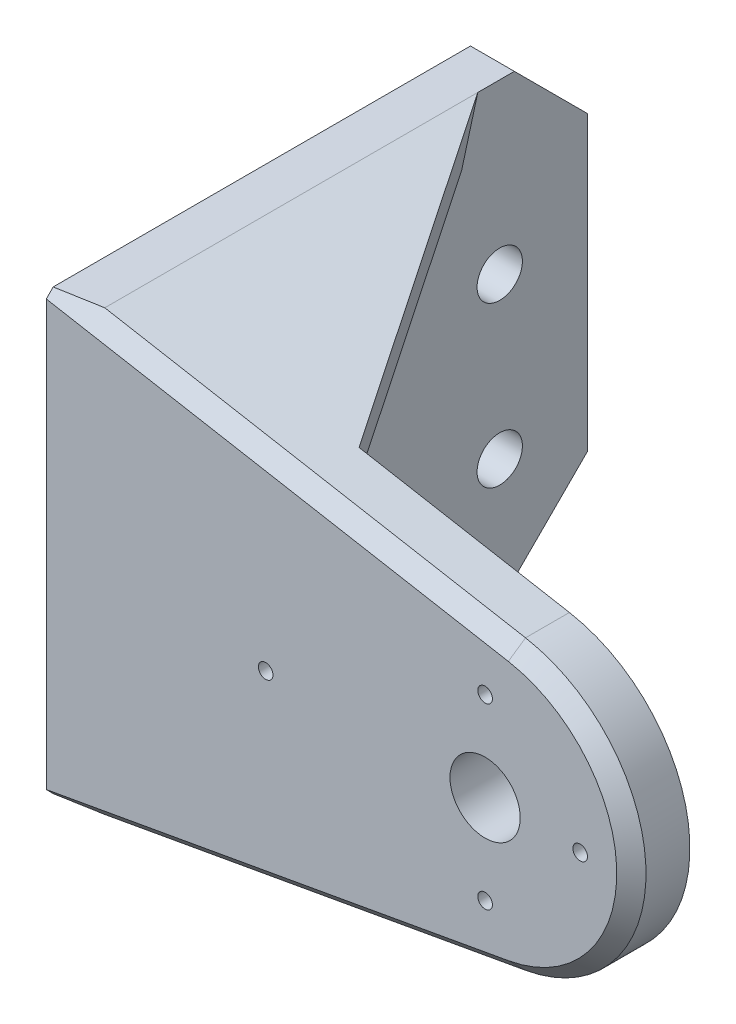
ISO-10303-21;
HEADER;
FILE_DESCRIPTION(('STEP AP214'),'2;1');
FILE_NAME('part.step','',(''),(''),'','','');
FILE_SCHEMA(('AUTOMOTIVE_DESIGN { 1 0 10303 214 1 1 1 1 }'));
ENDSEC;
DATA;
#1=APPLICATION_CONTEXT('core data for automotive mechanical design processes');
#2=APPLICATION_PROTOCOL_DEFINITION('international standard','automotive_design',2000,#1);
#3=PRODUCT_CONTEXT('',#1,'mechanical');
#4=PRODUCT('Part','Part','',(#3));
#5=PRODUCT_RELATED_PRODUCT_CATEGORY('part','',(#4));
#6=PRODUCT_DEFINITION_FORMATION('','',#4);
#7=PRODUCT_DEFINITION_CONTEXT('part definition',#1,'design');
#8=PRODUCT_DEFINITION('design','',#6,#7);
#9=PRODUCT_DEFINITION_SHAPE('','',#8);
#10=(LENGTH_UNIT() NAMED_UNIT(*) SI_UNIT(.MILLI.,.METRE.));
#11=(NAMED_UNIT(*) PLANE_ANGLE_UNIT() SI_UNIT($,.RADIAN.));
#12=(NAMED_UNIT(*) SI_UNIT($,.STERADIAN.) SOLID_ANGLE_UNIT());
#13=UNCERTAINTY_MEASURE_WITH_UNIT(LENGTH_MEASURE(1.E-05),#10,'distance_accuracy_value','');
#14=(GEOMETRIC_REPRESENTATION_CONTEXT(3) GLOBAL_UNCERTAINTY_ASSIGNED_CONTEXT((#13)) GLOBAL_UNIT_ASSIGNED_CONTEXT((#10,
#11,#12)) REPRESENTATION_CONTEXT('',''));
#15=CARTESIAN_POINT('',(0.,0.,0.));
#16=DIRECTION('',(0.,0.,1.));
#17=DIRECTION('',(1.,0.,0.));
#18=AXIS2_PLACEMENT_3D('',#15,#16,#17);
#19=CARTESIAN_POINT('',(0.,0.,0.));
#20=DIRECTION('',(0.,0.,1.));
#21=DIRECTION('',(1.,0.,0.));
#22=AXIS2_PLACEMENT_3D('',#19,#20,#21);
#23=PLANE('',#22);
#24=CARTESIAN_POINT('',(12.0560000000025,5.55625000000321,0.));
#25=DIRECTION('',(0.,0.,-1.));
#26=DIRECTION('',(-1.,0.,0.));
#27=AXIS2_PLACEMENT_3D('',#24,#25,#26);
#28=CIRCLE('',#27,0.5000000000014);
#29=CARTESIAN_POINT('',(11.5560000000011,5.55625000000321,0.));
#30=VERTEX_POINT('',#29);
#31=EDGE_CURVE('E384',#30,#30,#28,.T.);
#32=ORIENTED_EDGE('',*,*,#31,.F.);
#33=EDGE_LOOP('',(#32));
#34=FACE_BOUND('',#33,.T.);
#35=CARTESIAN_POINT('',(5.55600000000246,-0.54374999999679,0.));
#36=DIRECTION('',(0.,0.,-1.));
#37=DIRECTION('',(-1.,0.,0.));
#38=AXIS2_PLACEMENT_3D('',#35,#36,#37);
#39=CIRCLE('',#38,0.5000000000014);
#40=CARTESIAN_POINT('',(5.05600000000106,-0.54374999999679,0.));
#41=VERTEX_POINT('',#40);
#42=EDGE_CURVE('E378',#41,#41,#39,.T.);
#43=ORIENTED_EDGE('',*,*,#42,.F.);
#44=EDGE_LOOP('',(#43));
#45=FACE_BOUND('',#44,.T.);
#46=CARTESIAN_POINT('',(5.55600000000249,11.6562500000032,0.));
#47=DIRECTION('',(0.,0.,-1.));
#48=DIRECTION('',(-1.,0.,0.));
#49=AXIS2_PLACEMENT_3D('',#46,#47,#48);
#50=CIRCLE('',#49,0.500000000001399);
#51=CARTESIAN_POINT('',(5.05600000000109,11.6562500000032,0.));
#52=VERTEX_POINT('',#51);
#53=EDGE_CURVE('E372',#52,#52,#50,.T.);
#54=ORIENTED_EDGE('',*,*,#53,.F.);
#55=EDGE_LOOP('',(#54));
#56=FACE_BOUND('',#55,.T.);
#57=CARTESIAN_POINT('',(-9.44399999999753,5.55625000000328,0.));
#58=DIRECTION('',(0.,0.,-1.));
#59=DIRECTION('',(-1.,0.,0.));
#60=AXIS2_PLACEMENT_3D('',#57,#58,#59);
#61=CIRCLE('',#60,0.500000000001401);
#62=CARTESIAN_POINT('',(-9.94399999999893,5.55625000000328,0.));
#63=VERTEX_POINT('',#62);
#64=EDGE_CURVE('E366',#63,#63,#61,.T.);
#65=ORIENTED_EDGE('',*,*,#64,.F.);
#66=EDGE_LOOP('',(#65));
#67=FACE_BOUND('',#66,.T.);
#68=CARTESIAN_POINT('',(5.55600000000001,5.55624999999998,0.));
#69=DIRECTION('',(0.,0.,-1.));
#70=DIRECTION('',(-1.,0.,0.));
#71=AXIS2_PLACEMENT_3D('',#68,#69,#70);
#72=CIRCLE('',#71,2.4);
#73=CARTESIAN_POINT('',(3.15600000000001,5.55624999999998,0.));
#74=VERTEX_POINT('',#73);
#75=EDGE_CURVE('E362',#74,#74,#72,.T.);
#76=ORIENTED_EDGE('',*,*,#75,.F.);
#77=EDGE_LOOP('',(#76));
#78=FACE_BOUND('',#77,.T.);
#79=DIRECTION('',(0.984306621168693,0.176466641390014,0.));
#80=VECTOR('',#79,1.);
#81=CARTESIAN_POINT('',(0.972577364263921,-5.42490258613799,0.));
#82=LINE('',#81,#80);
#83=CARTESIAN_POINT('',(-16.444,-8.54734923628022,0.));
#84=VERTEX_POINT('',#83);
#85=CARTESIAN_POINT('',(7.32066641390016,-4.28681621168694,0.));
#86=VERTEX_POINT('',#85);
#87=EDGE_CURVE('E149',#84,#86,#82,.T.);
#88=ORIENTED_EDGE('',*,*,#87,.F.);
#89=DIRECTION('',(0.,1.,0.));
#90=VECTOR('',#89,1.);
#91=CARTESIAN_POINT('',(-16.444,16.4924756496348,0.));
#92=LINE('',#91,#90);
#93=CARTESIAN_POINT('',(-16.444,15.596074885915,0.));
#94=VERTEX_POINT('',#93);
#95=EDGE_CURVE('E181',#84,#94,#92,.T.);
#96=ORIENTED_EDGE('',*,*,#95,.T.);
#97=DIRECTION('',(-0.984306621168693,0.176466641390014,0.));
#98=VECTOR('',#97,1.);
#99=CARTESIAN_POINT('',(2.19692186199313,12.2541275672086,0.));
#100=LINE('',#99,#98);
#101=CARTESIAN_POINT('',(-7.76753335860997,14.0405566211687,0.));
#102=VERTEX_POINT('',#101);
#103=EDGE_CURVE('E247',#102,#94,#100,.T.);
#104=ORIENTED_EDGE('',*,*,#103,.F.);
#105=DIRECTION('',(0.176466641390014,0.984306621168692,0.));
#106=VECTOR('',#105,1.);
#107=CARTESIAN_POINT('',(-7.76753335860997,14.0405566211687,0.));
#108=LINE('',#107,#106);
#109=CARTESIAN_POINT('',(-7.06166679304992,17.9777831058435,0.));
#110=VERTEX_POINT('',#109);
#111=EDGE_CURVE('E243',#102,#110,#108,.T.);
#112=ORIENTED_EDGE('',*,*,#111,.T.);
#113=DIRECTION('',(0.984306621168693,-0.176466641390014,0.));
#114=VECTOR('',#113,1.);
#115=CARTESIAN_POINT('',(2.90278842755319,16.1913540518834,0.));
#116=LINE('',#115,#114);
#117=CARTESIAN_POINT('',(7.32066641390015,15.3993162116869,0.));
#118=VERTEX_POINT('',#117);
#119=EDGE_CURVE('E159',#110,#118,#116,.T.);
#120=ORIENTED_EDGE('',*,*,#119,.T.);
#121=CARTESIAN_POINT('',(5.55600000000001,5.55624999999998,0.));
#122=DIRECTION('',(0.,0.,1.));
#123=DIRECTION('',(1.,0.,0.));
#124=AXIS2_PLACEMENT_3D('',#121,#122,#123);
#125=CIRCLE('',#124,10.);
#126=EDGE_CURVE('E140',#86,#118,#125,.T.);
#127=ORIENTED_EDGE('',*,*,#126,.F.);
#128=EDGE_LOOP('',(#88,#96,#104,#112,#120,#127));
#129=FACE_BOUND('',#128,.T.);
#130=ADVANCED_FACE('F35',(#34,#45,#56,#67,#78,#129),#23,.F.);
#131=CARTESIAN_POINT('',(0.972577364263921,-5.42490258613799,4.));
#132=DIRECTION('',(-0.176466641390014,0.984306621168692,0.));
#133=DIRECTION('',(-0.984306621168693,-0.176466641390014,0.));
#134=AXIS2_PLACEMENT_3D('',#131,#132,#133);
#135=PLANE('',#134);
#136=DIRECTION('',(0.,0.,-1.));
#137=VECTOR('',#136,1.);
#138=CARTESIAN_POINT('',(7.32066641390016,-4.28681621168694,4.));
#139=LINE('',#138,#137);
#140=CARTESIAN_POINT('',(7.32066641390016,-4.28681621168694,3.));
#141=VERTEX_POINT('',#140);
#142=EDGE_CURVE('E136',#141,#86,#139,.T.);
#143=ORIENTED_EDGE('',*,*,#142,.F.);
#144=DIRECTION('',(-0.984306621168693,-0.176466641390014,0.));
#145=VECTOR('',#144,1.);
#146=CARTESIAN_POINT('',(-21.444,-9.44375000000001,3.));
#147=LINE('',#146,#145);
#148=CARTESIAN_POINT('',(-21.444,-9.44375000000001,3.));
#149=VERTEX_POINT('',#148);
#150=EDGE_CURVE('E213',#141,#149,#147,.T.);
#151=ORIENTED_EDGE('',*,*,#150,.T.);
#152=DIRECTION('',(0.,0.,-1.));
#153=VECTOR('',#152,1.);
#154=CARTESIAN_POINT('',(-21.444,-9.44375000000001,4.));
#155=LINE('',#154,#153);
#156=CARTESIAN_POINT('',(-21.444,-9.44375000000001,-5.00000000000004));
#157=VERTEX_POINT('',#156);
#158=EDGE_CURVE('E165',#149,#157,#155,.T.);
#159=ORIENTED_EDGE('',*,*,#158,.T.);
#160=DIRECTION('',(-0.70149251439437,-0.125763685129367,-0.701492514394377));
#161=VECTOR('',#160,1.);
#162=CARTESIAN_POINT('',(-5.62960963975787,-6.6085436806632,10.8143903602422));
#163=LINE('',#162,#161);
#164=EDGE_CURVE('E152',#157,#84,#163,.F.);
#165=ORIENTED_EDGE('',*,*,#164,.T.);
#166=ORIENTED_EDGE('',*,*,#87,.T.);
#167=EDGE_LOOP('',(#143,#151,#159,#165,#166));
#168=FACE_BOUND('',#167,.T.);
#169=ADVANCED_FACE('F150',(#168),#135,.F.);
#170=CARTESIAN_POINT('',(5.55600000000001,5.55624999999998,4.));
#171=DIRECTION('',(0.,0.,-1.));
#172=DIRECTION('',(-1.,0.,0.));
#173=AXIS2_PLACEMENT_3D('',#170,#171,#172);
#174=CYLINDRICAL_SURFACE('',#173,10.);
#175=DIRECTION('',(0.,0.,-1.));
#176=VECTOR('',#175,1.);
#177=CARTESIAN_POINT('',(7.32066641390015,15.3993162116869,4.));
#178=LINE('',#177,#176);
#179=CARTESIAN_POINT('',(7.32066641390015,15.3993162116869,3.));
#180=VERTEX_POINT('',#179);
#181=EDGE_CURVE('E146',#180,#118,#178,.T.);
#182=ORIENTED_EDGE('',*,*,#181,.F.);
#183=CARTESIAN_POINT('',(5.55600000000001,5.55624999999998,3.));
#184=DIRECTION('',(0.,0.,1.));
#185=DIRECTION('',(1.,0.,0.));
#186=AXIS2_PLACEMENT_3D('',#183,#184,#185);
#187=CIRCLE('',#186,10.);
#188=EDGE_CURVE('E142',#180,#141,#187,.F.);
#189=ORIENTED_EDGE('',*,*,#188,.T.);
#190=ORIENTED_EDGE('',*,*,#142,.T.);
#191=ORIENTED_EDGE('',*,*,#126,.T.);
#192=EDGE_LOOP('',(#182,#189,#190,#191));
#193=FACE_BOUND('',#192,.T.);
#194=ADVANCED_FACE('F138',(#193),#174,.T.);
#195=CARTESIAN_POINT('',(2.90278842755319,16.1913540518834,4.));
#196=DIRECTION('',(0.176466641390014,0.984306621168692,0.));
#197=DIRECTION('',(-0.984306621168693,0.176466641390014,0.));
#198=AXIS2_PLACEMENT_3D('',#195,#196,#197);
#199=PLANE('',#198);
#200=DIRECTION('',(0.,0.,-1.));
#201=VECTOR('',#200,1.);
#202=CARTESIAN_POINT('',(-21.444,20.55625,4.));
#203=LINE('',#202,#201);
#204=CARTESIAN_POINT('',(-21.444,20.55625,3.));
#205=VERTEX_POINT('',#204);
#206=CARTESIAN_POINT('',(-21.444,20.55625,-22.5));
#207=VERTEX_POINT('',#206);
#208=EDGE_CURVE('E171',#205,#207,#203,.T.);
#209=ORIENTED_EDGE('',*,*,#208,.F.);
#210=DIRECTION('',(0.984306621168693,-0.176466641390014,0.));
#211=VECTOR('',#210,1.);
#212=CARTESIAN_POINT('',(2.90278842755319,16.1913540518834,3.));
#213=LINE('',#212,#211);
#214=EDGE_CURVE('E44',#205,#180,#213,.T.);
#215=ORIENTED_EDGE('',*,*,#214,.T.);
#216=ORIENTED_EDGE('',*,*,#181,.T.);
#217=ORIENTED_EDGE('',*,*,#119,.F.);
#218=DIRECTION('',(-0.536090991529758,0.0961104748461159,-0.838671106826446));
#219=VECTOR('',#218,1.);
#220=CARTESIAN_POINT('',(-21.444,20.55625,-22.5));
#221=LINE('',#220,#219);
#222=EDGE_CURVE('E229',#110,#207,#221,.T.);
#223=ORIENTED_EDGE('',*,*,#222,.T.);
#224=EDGE_LOOP('',(#209,#215,#216,#217,#223));
#225=FACE_BOUND('',#224,.T.);
#226=ADVANCED_FACE('F311',(#225),#199,.T.);
#227=CARTESIAN_POINT('',(0.,20.55625,4.));
#228=DIRECTION('',(0.,1.,0.));
#229=DIRECTION('',(0.,0.,1.));
#230=AXIS2_PLACEMENT_3D('',#227,#228,#229);
#231=PLANE('',#230);
#232=DIRECTION('',(0.,0.,-1.));
#233=VECTOR('',#232,1.);
#234=CARTESIAN_POINT('',(-24.444,20.55625,4.));
#235=LINE('',#234,#233);
#236=CARTESIAN_POINT('',(-24.444,20.55625,3.52939992417003));
#237=VERTEX_POINT('',#236);
#238=CARTESIAN_POINT('',(-24.444,20.55625,-25.));
#239=VERTEX_POINT('',#238);
#240=EDGE_CURVE('E169',#237,#239,#235,.T.);
#241=ORIENTED_EDGE('',*,*,#240,.F.);
#242=DIRECTION('',(-0.984784223999781,0.,0.173781564503111));
#243=VECTOR('',#242,1.);
#244=CARTESIAN_POINT('',(-0.818746832808342,20.55625,-0.639669154233028));
#245=LINE('',#244,#243);
#246=EDGE_CURVE('E11',#237,#205,#245,.F.);
#247=ORIENTED_EDGE('',*,*,#246,.T.);
#248=ORIENTED_EDGE('',*,*,#208,.T.);
#249=DIRECTION('',(0.,0.,1.));
#250=VECTOR('',#249,1.);
#251=CARTESIAN_POINT('',(-21.444,20.55625,-30.));
#252=LINE('',#251,#250);
#253=CARTESIAN_POINT('',(-21.444,20.55625,-25.));
#254=VERTEX_POINT('',#253);
#255=EDGE_CURVE('E155',#254,#207,#252,.T.);
#256=ORIENTED_EDGE('',*,*,#255,.F.);
#257=DIRECTION('',(-1.,0.,0.));
#258=VECTOR('',#257,1.);
#259=CARTESIAN_POINT('',(0.,20.55625,-25.));
#260=LINE('',#259,#258);
#261=EDGE_CURVE('E203',#254,#239,#260,.T.);
#262=ORIENTED_EDGE('',*,*,#261,.T.);
#263=EDGE_LOOP('',(#241,#247,#248,#256,#262));
#264=FACE_BOUND('',#263,.T.);
#265=ADVANCED_FACE('F282',(#264),#231,.T.);
#266=CARTESIAN_POINT('',(-24.444,0.,4.));
#267=DIRECTION('',(1.,0.,0.));
#268=DIRECTION('',(0.,0.,-1.));
#269=AXIS2_PLACEMENT_3D('',#266,#267,#268);
#270=PLANE('',#269);
#271=CARTESIAN_POINT('',(-24.444,-1.88980237845015,-24.));
#272=DIRECTION('',(1.,0.,0.));
#273=DIRECTION('',(0.,0.,-1.));
#274=AXIS2_PLACEMENT_3D('',#271,#272,#273);
#275=CIRCLE('',#274,1.55);
#276=CARTESIAN_POINT('',(-24.444,-1.88980237845015,-25.55));
#277=VERTEX_POINT('',#276);
#278=EDGE_CURVE('E341',#277,#277,#275,.F.);
#279=ORIENTED_EDGE('',*,*,#278,.F.);
#280=EDGE_LOOP('',(#279));
#281=FACE_BOUND('',#280,.T.);
#282=CARTESIAN_POINT('',(-24.444,-1.88980237845016,-11.));
#283=DIRECTION('',(1.,0.,0.));
#284=DIRECTION('',(0.,0.,-1.));
#285=AXIS2_PLACEMENT_3D('',#282,#283,#284);
#286=CIRCLE('',#285,1.55);
#287=CARTESIAN_POINT('',(-24.444,-1.88980237845016,-12.55));
#288=VERTEX_POINT('',#287);
#289=EDGE_CURVE('E345',#288,#288,#286,.F.);
#290=ORIENTED_EDGE('',*,*,#289,.F.);
#291=EDGE_LOOP('',(#290));
#292=FACE_BOUND('',#291,.T.);
#293=CARTESIAN_POINT('',(-24.444,9.04722097950028,-24.));
#294=DIRECTION('',(1.,0.,0.));
#295=DIRECTION('',(0.,0.,-1.));
#296=AXIS2_PLACEMENT_3D('',#293,#294,#295);
#297=CIRCLE('',#296,1.55);
#298=CARTESIAN_POINT('',(-24.444,9.04722097950028,-25.55));
#299=VERTEX_POINT('',#298);
#300=EDGE_CURVE('E236',#299,#299,#297,.F.);
#301=ORIENTED_EDGE('',*,*,#300,.F.);
#302=EDGE_LOOP('',(#301));
#303=FACE_BOUND('',#302,.T.);
#304=CARTESIAN_POINT('',(-24.444,9.04722097950028,-11.));
#305=DIRECTION('',(1.,0.,0.));
#306=DIRECTION('',(0.,0.,-1.));
#307=AXIS2_PLACEMENT_3D('',#304,#305,#306);
#308=CIRCLE('',#307,1.55);
#309=CARTESIAN_POINT('',(-24.444,9.04722097950028,-12.55));
#310=VERTEX_POINT('',#309);
#311=EDGE_CURVE('E223',#310,#310,#308,.F.);
#312=ORIENTED_EDGE('',*,*,#311,.F.);
#313=EDGE_LOOP('',(#312));
#314=FACE_BOUND('',#313,.T.);
#315=DIRECTION('',(0.,0.,-1.));
#316=VECTOR('',#315,1.);
#317=CARTESIAN_POINT('',(-24.444,-9.44375000000001,4.));
#318=LINE('',#317,#316);
#319=CARTESIAN_POINT('',(-24.444,-9.44375000000001,3.52939992417003));
#320=VERTEX_POINT('',#319);
#321=CARTESIAN_POINT('',(-24.444,-9.44375000000001,-25.));
#322=VERTEX_POINT('',#321);
#323=EDGE_CURVE('E167',#320,#322,#318,.T.);
#324=ORIENTED_EDGE('',*,*,#323,.F.);
#325=DIRECTION('',(0.,0.712676821742271,0.70149251439437));
#326=VECTOR('',#325,1.);
#327=CARTESIAN_POINT('',(-24.444,-6.66733617380483,6.26224243639823));
#328=LINE('',#327,#326);
#329=CARTESIAN_POINT('',(-24.444,-8.96564687064057,4.));
#330=VERTEX_POINT('',#329);
#331=EDGE_CURVE('E219',#320,#330,#328,.T.);
#332=ORIENTED_EDGE('',*,*,#331,.T.);
#333=DIRECTION('',(0.,-1.,0.));
#334=VECTOR('',#333,1.);
#335=CARTESIAN_POINT('',(-24.444,0.,4.));
#336=LINE('',#335,#334);
#337=CARTESIAN_POINT('',(-24.444,20.0781468706405,4.));
#338=VERTEX_POINT('',#337);
#339=EDGE_CURVE('E161',#338,#330,#336,.T.);
#340=ORIENTED_EDGE('',*,*,#339,.F.);
#341=DIRECTION('',(0.,-0.712676821742271,0.70149251439437));
#342=VECTOR('',#341,1.);
#343=CARTESIAN_POINT('',(-24.444,18.6039501788475,5.45106156463686));
#344=LINE('',#343,#342);
#345=EDGE_CURVE('E217',#338,#237,#344,.F.);
#346=ORIENTED_EDGE('',*,*,#345,.T.);
#347=ORIENTED_EDGE('',*,*,#240,.T.);
#348=DIRECTION('',(0.,0.707106781186547,0.707106781186548));
#349=VECTOR('',#348,1.);
#350=CARTESIAN_POINT('',(-24.444,15.55625,-30.));
#351=LINE('',#350,#349);
#352=CARTESIAN_POINT('',(-24.444,15.55625,-30.));
#353=VERTEX_POINT('',#352);
#354=EDGE_CURVE('E192',#239,#353,#351,.F.);
#355=ORIENTED_EDGE('',*,*,#354,.T.);
#356=DIRECTION('',(0.,1.,0.));
#357=VECTOR('',#356,1.);
#358=CARTESIAN_POINT('',(-24.444,-9.44375000000001,-30.));
#359=LINE('',#358,#357);
#360=CARTESIAN_POINT('',(-24.444,-4.44375000000002,-30.));
#361=VERTEX_POINT('',#360);
#362=EDGE_CURVE('E253',#361,#353,#359,.T.);
#363=ORIENTED_EDGE('',*,*,#362,.F.);
#364=DIRECTION('',(0.,-0.707106781186547,0.707106781186548));
#365=VECTOR('',#364,1.);
#366=CARTESIAN_POINT('',(-24.444,-4.44375000000002,-30.));
#367=LINE('',#366,#365);
#368=EDGE_CURVE('E194',#361,#322,#367,.T.);
#369=ORIENTED_EDGE('',*,*,#368,.T.);
#370=EDGE_LOOP('',(#324,#332,#340,#346,#347,#355,#363,#369));
#371=FACE_BOUND('',#370,.T.);
#372=ADVANCED_FACE('F271',(#281,#292,#303,#314,#371),#270,.F.);
#373=CARTESIAN_POINT('',(0.,-9.44375000000001,4.));
#374=DIRECTION('',(0.,1.,0.));
#375=DIRECTION('',(0.,0.,1.));
#376=AXIS2_PLACEMENT_3D('',#373,#374,#375);
#377=PLANE('',#376);
#378=ORIENTED_EDGE('',*,*,#158,.F.);
#379=DIRECTION('',(-0.984784223999781,0.,0.173781564503111));
#380=VECTOR('',#379,1.);
#381=CARTESIAN_POINT('',(-0.0466786793690646,-9.44375000000001,-0.775913428194647));
#382=LINE('',#381,#380);
#383=EDGE_CURVE('E215',#149,#320,#382,.T.);
#384=ORIENTED_EDGE('',*,*,#383,.T.);
#385=ORIENTED_EDGE('',*,*,#323,.T.);
#386=DIRECTION('',(1.,0.,0.));
#387=VECTOR('',#386,1.);
#388=CARTESIAN_POINT('',(-21.444,-9.44375000000001,-25.));
#389=LINE('',#388,#387);
#390=CARTESIAN_POINT('',(-21.444,-9.44375000000001,-25.));
#391=VERTEX_POINT('',#390);
#392=EDGE_CURVE('E197',#322,#391,#389,.T.);
#393=ORIENTED_EDGE('',*,*,#392,.T.);
#394=DIRECTION('',(0.,0.,1.));
#395=VECTOR('',#394,1.);
#396=CARTESIAN_POINT('',(-21.444,-9.44375000000001,-30.));
#397=LINE('',#396,#395);
#398=EDGE_CURVE('E256',#391,#157,#397,.T.);
#399=ORIENTED_EDGE('',*,*,#398,.T.);
#400=EDGE_LOOP('',(#378,#384,#385,#393,#399));
#401=FACE_BOUND('',#400,.T.);
#402=ADVANCED_FACE('F276',(#401),#377,.F.);
#403=CARTESIAN_POINT('',(0.,0.,4.));
#404=DIRECTION('',(0.,0.,1.));
#405=DIRECTION('',(1.,0.,0.));
#406=AXIS2_PLACEMENT_3D('',#403,#404,#405);
#407=PLANE('',#406);
#408=CARTESIAN_POINT('',(12.0560000000025,5.55625000000321,4.));
#409=DIRECTION('',(0.,0.,1.));
#410=DIRECTION('',(1.,0.,0.));
#411=AXIS2_PLACEMENT_3D('',#408,#409,#410);
#412=CIRCLE('',#411,0.5000000000014);
#413=CARTESIAN_POINT('',(12.5560000000039,5.55625000000321,4.));
#414=VERTEX_POINT('',#413);
#415=EDGE_CURVE('E387',#414,#414,#412,.F.);
#416=ORIENTED_EDGE('',*,*,#415,.T.);
#417=EDGE_LOOP('',(#416));
#418=FACE_BOUND('',#417,.T.);
#419=CARTESIAN_POINT('',(5.55600000000246,-0.54374999999679,4.));
#420=DIRECTION('',(0.,0.,1.));
#421=DIRECTION('',(1.,0.,0.));
#422=AXIS2_PLACEMENT_3D('',#419,#420,#421);
#423=CIRCLE('',#422,0.5000000000014);
#424=CARTESIAN_POINT('',(6.05600000000386,-0.54374999999679,4.));
#425=VERTEX_POINT('',#424);
#426=EDGE_CURVE('E381',#425,#425,#423,.F.);
#427=ORIENTED_EDGE('',*,*,#426,.T.);
#428=EDGE_LOOP('',(#427));
#429=FACE_BOUND('',#428,.T.);
#430=CARTESIAN_POINT('',(5.55600000000249,11.6562500000032,4.));
#431=DIRECTION('',(0.,0.,1.));
#432=DIRECTION('',(1.,0.,0.));
#433=AXIS2_PLACEMENT_3D('',#430,#431,#432);
#434=CIRCLE('',#433,0.500000000001399);
#435=CARTESIAN_POINT('',(6.05600000000389,11.6562500000032,4.));
#436=VERTEX_POINT('',#435);
#437=EDGE_CURVE('E375',#436,#436,#434,.F.);
#438=ORIENTED_EDGE('',*,*,#437,.T.);
#439=EDGE_LOOP('',(#438));
#440=FACE_BOUND('',#439,.T.);
#441=CARTESIAN_POINT('',(-9.44399999999753,5.55625000000328,4.));
#442=DIRECTION('',(0.,0.,1.));
#443=DIRECTION('',(1.,0.,0.));
#444=AXIS2_PLACEMENT_3D('',#441,#442,#443);
#445=CIRCLE('',#444,0.500000000001401);
#446=CARTESIAN_POINT('',(-8.94399999999613,5.55625000000328,4.));
#447=VERTEX_POINT('',#446);
#448=EDGE_CURVE('E369',#447,#447,#445,.F.);
#449=ORIENTED_EDGE('',*,*,#448,.T.);
#450=EDGE_LOOP('',(#449));
#451=FACE_BOUND('',#450,.T.);
#452=CARTESIAN_POINT('',(5.55600000000001,5.55624999999998,4.));
#453=DIRECTION('',(0.,0.,1.));
#454=DIRECTION('',(1.,0.,0.));
#455=AXIS2_PLACEMENT_3D('',#452,#453,#454);
#456=CIRCLE('',#455,2.4);
#457=CARTESIAN_POINT('',(7.95600000000001,5.55624999999998,4.));
#458=VERTEX_POINT('',#457);
#459=EDGE_CURVE('E363',#458,#458,#456,.F.);
#460=ORIENTED_EDGE('',*,*,#459,.T.);
#461=EDGE_LOOP('',(#460));
#462=FACE_BOUND('',#461,.T.);
#463=ORIENTED_EDGE('',*,*,#339,.T.);
#464=DIRECTION('',(0.984306621168693,0.176466641390014,0.));
#465=VECTOR('',#464,1.);
#466=CARTESIAN_POINT('',(7.14419977251014,-3.30250959051824,4.));
#467=LINE('',#466,#465);
#468=CARTESIAN_POINT('',(7.14419977251014,-3.30250959051823,4.));
#469=VERTEX_POINT('',#468);
#470=EDGE_CURVE('E210',#330,#469,#467,.T.);
#471=ORIENTED_EDGE('',*,*,#470,.T.);
#472=CARTESIAN_POINT('',(5.55600000000001,5.55624999999998,4.));
#473=DIRECTION('',(0.,0.,1.));
#474=DIRECTION('',(1.,0.,0.));
#475=AXIS2_PLACEMENT_3D('',#472,#473,#474);
#476=CIRCLE('',#475,8.99999999999999);
#477=CARTESIAN_POINT('',(7.14419977251014,14.4150095905182,4.));
#478=VERTEX_POINT('',#477);
#479=EDGE_CURVE('E208',#469,#478,#476,.T.);
#480=ORIENTED_EDGE('',*,*,#479,.T.);
#481=DIRECTION('',(-0.984306621168693,0.176466641390014,0.));
#482=VECTOR('',#481,1.);
#483=CARTESIAN_POINT('',(2.72632178616317,15.2070474307147,4.));
#484=LINE('',#483,#482);
#485=EDGE_CURVE('E206',#478,#338,#484,.T.);
#486=ORIENTED_EDGE('',*,*,#485,.T.);
#487=EDGE_LOOP('',(#463,#471,#480,#486));
#488=FACE_BOUND('',#487,.T.);
#489=ADVANCED_FACE('F263',(#418,#429,#440,#451,#462,#488),#407,.T.);
#490=CARTESIAN_POINT('',(-21.444,20.55625,-30.));
#491=DIRECTION('',(-1.,0.,0.));
#492=DIRECTION('',(0.,0.,1.));
#493=AXIS2_PLACEMENT_3D('',#490,#491,#492);
#494=PLANE('',#493);
#495=CARTESIAN_POINT('',(-21.444,-1.88980237845015,-24.));
#496=DIRECTION('',(1.,0.,0.));
#497=DIRECTION('',(0.,0.,-1.));
#498=AXIS2_PLACEMENT_3D('',#495,#496,#497);
#499=CIRCLE('',#498,1.55);
#500=CARTESIAN_POINT('',(-21.444,-1.88980237845015,-25.55));
#501=VERTEX_POINT('',#500);
#502=EDGE_CURVE('E359',#501,#501,#499,.T.);
#503=ORIENTED_EDGE('',*,*,#502,.F.);
#504=EDGE_LOOP('',(#503));
#505=FACE_BOUND('',#504,.T.);
#506=CARTESIAN_POINT('',(-21.444,-1.88980237845016,-11.));
#507=DIRECTION('',(1.,0.,0.));
#508=DIRECTION('',(0.,0.,-1.));
#509=AXIS2_PLACEMENT_3D('',#506,#507,#508);
#510=CIRCLE('',#509,1.55);
#511=CARTESIAN_POINT('',(-21.444,-1.88980237845016,-12.55));
#512=VERTEX_POINT('',#511);
#513=EDGE_CURVE('E355',#512,#512,#510,.T.);
#514=ORIENTED_EDGE('',*,*,#513,.F.);
#515=EDGE_LOOP('',(#514));
#516=FACE_BOUND('',#515,.T.);
#517=CARTESIAN_POINT('',(-21.444,9.04722097950028,-24.));
#518=DIRECTION('',(1.,0.,0.));
#519=DIRECTION('',(0.,0.,-1.));
#520=AXIS2_PLACEMENT_3D('',#517,#518,#519);
#521=CIRCLE('',#520,1.55);
#522=CARTESIAN_POINT('',(-21.444,9.04722097950028,-25.55));
#523=VERTEX_POINT('',#522);
#524=EDGE_CURVE('E350',#523,#523,#521,.T.);
#525=ORIENTED_EDGE('',*,*,#524,.F.);
#526=EDGE_LOOP('',(#525));
#527=FACE_BOUND('',#526,.T.);
#528=CARTESIAN_POINT('',(-21.444,9.04722097950028,-11.));
#529=DIRECTION('',(1.,0.,0.));
#530=DIRECTION('',(0.,0.,-1.));
#531=AXIS2_PLACEMENT_3D('',#528,#529,#530);
#532=CIRCLE('',#531,1.55);
#533=CARTESIAN_POINT('',(-21.444,9.04722097950028,-12.55));
#534=VERTEX_POINT('',#533);
#535=EDGE_CURVE('E231',#534,#534,#532,.T.);
#536=ORIENTED_EDGE('',*,*,#535,.F.);
#537=EDGE_LOOP('',(#536));
#538=FACE_BOUND('',#537,.T.);
#539=ORIENTED_EDGE('',*,*,#398,.F.);
#540=DIRECTION('',(0.,0.707106781186547,-0.707106781186548));
#541=VECTOR('',#540,1.);
#542=CARTESIAN_POINT('',(-21.444,-4.44375000000002,-30.));
#543=LINE('',#542,#541);
#544=CARTESIAN_POINT('',(-21.444,-4.44375000000002,-30.));
#545=VERTEX_POINT('',#544);
#546=EDGE_CURVE('E201',#391,#545,#543,.T.);
#547=ORIENTED_EDGE('',*,*,#546,.T.);
#548=DIRECTION('',(0.,-1.,0.));
#549=VECTOR('',#548,1.);
#550=CARTESIAN_POINT('',(-21.444,20.55625,-30.));
#551=LINE('',#550,#549);
#552=CARTESIAN_POINT('',(-21.444,15.55625,-30.));
#553=VERTEX_POINT('',#552);
#554=EDGE_CURVE('E250',#553,#545,#551,.T.);
#555=ORIENTED_EDGE('',*,*,#554,.F.);
#556=DIRECTION('',(0.,-0.707106781186547,-0.707106781186548));
#557=VECTOR('',#556,1.);
#558=CARTESIAN_POINT('',(-21.444,15.55625,-30.));
#559=LINE('',#558,#557);
#560=EDGE_CURVE('E199',#553,#254,#559,.F.);
#561=ORIENTED_EDGE('',*,*,#560,.T.);
#562=ORIENTED_EDGE('',*,*,#255,.T.);
#563=DIRECTION('',(0.,-0.965006385351043,0.262226383553817));
#564=VECTOR('',#563,1.);
#565=CARTESIAN_POINT('',(-21.444,22.4541260090271,-23.0157200717379));
#566=LINE('',#565,#564);
#567=CARTESIAN_POINT('',(-21.444,16.4924756496348,-21.3957287043366));
#568=VERTEX_POINT('',#567);
#569=EDGE_CURVE('E175',#207,#568,#566,.T.);
#570=ORIENTED_EDGE('',*,*,#569,.T.);
#571=DIRECTION('',(0.,0.,-1.));
#572=VECTOR('',#571,1.);
#573=CARTESIAN_POINT('',(-21.444,16.4924756496348,-30.));
#574=LINE('',#573,#572);
#575=CARTESIAN_POINT('',(-21.444,16.4924756496348,-5.00000000000004));
#576=VERTEX_POINT('',#575);
#577=EDGE_CURVE('E145',#576,#568,#574,.T.);
#578=ORIENTED_EDGE('',*,*,#577,.F.);
#579=DIRECTION('',(0.,-1.,0.));
#580=VECTOR('',#579,1.);
#581=CARTESIAN_POINT('',(-21.444,-9.44375000000001,-5.00000000000004));
#582=LINE('',#581,#580);
#583=EDGE_CURVE('E178',#576,#157,#582,.T.);
#584=ORIENTED_EDGE('',*,*,#583,.T.);
#585=EDGE_LOOP('',(#539,#547,#555,#561,#562,#570,#578,#584));
#586=FACE_BOUND('',#585,.T.);
#587=ADVANCED_FACE('F297',(#505,#516,#527,#538,#586),#494,.F.);
#588=CARTESIAN_POINT('',(0.,0.,-30.));
#589=DIRECTION('',(0.,0.,-1.));
#590=DIRECTION('',(-1.,0.,0.));
#591=AXIS2_PLACEMENT_3D('',#588,#589,#590);
#592=PLANE('',#591);
#593=ORIENTED_EDGE('',*,*,#554,.T.);
#594=DIRECTION('',(-1.,0.,0.));
#595=VECTOR('',#594,1.);
#596=CARTESIAN_POINT('',(-24.444,-4.44375000000002,-30.));
#597=LINE('',#596,#595);
#598=EDGE_CURVE('E189',#545,#361,#597,.T.);
#599=ORIENTED_EDGE('',*,*,#598,.T.);
#600=ORIENTED_EDGE('',*,*,#362,.T.);
#601=DIRECTION('',(1.,0.,0.));
#602=VECTOR('',#601,1.);
#603=CARTESIAN_POINT('',(0.,15.55625,-30.));
#604=LINE('',#603,#602);
#605=EDGE_CURVE('E186',#353,#553,#604,.T.);
#606=ORIENTED_EDGE('',*,*,#605,.T.);
#607=EDGE_LOOP('',(#593,#599,#600,#606));
#608=FACE_BOUND('',#607,.T.);
#609=ADVANCED_FACE('F290',(#608),#592,.T.);
#610=CARTESIAN_POINT('',(-22.14986656556,16.6190235153252,-22.5));
#611=DIRECTION('',(0.825509523432146,-0.147997473452509,-0.544638205210124));
#612=DIRECTION('',(-0.550702686943466,0.,-0.834701473937387));
#613=AXIS2_PLACEMENT_3D('',#610,#611,#612);
#614=PLANE('',#613);
#615=ORIENTED_EDGE('',*,*,#569,.F.);
#616=ORIENTED_EDGE('',*,*,#222,.F.);
#617=ORIENTED_EDGE('',*,*,#111,.F.);
#618=DIRECTION('',(-0.536090991529758,0.0961104748461159,-0.838671106826446));
#619=VECTOR('',#618,1.);
#620=CARTESIAN_POINT('',(-22.14986656556,16.6190235153252,-22.5));
#621=LINE('',#620,#619);
#622=EDGE_CURVE('E240',#102,#568,#621,.T.);
#623=ORIENTED_EDGE('',*,*,#622,.T.);
#624=EDGE_LOOP('',(#615,#616,#617,#623));
#625=FACE_BOUND('',#624,.T.);
#626=ADVANCED_FACE('F309',(#625),#614,.T.);
#627=CARTESIAN_POINT('',(2.19692186199313,12.2541275672086,0.));
#628=DIRECTION('',(0.176466641390014,0.984306621168693,0.));
#629=DIRECTION('',(-0.984306621168693,0.176466641390014,0.));
#630=AXIS2_PLACEMENT_3D('',#627,#628,#629);
#631=PLANE('',#630);
#632=ORIENTED_EDGE('',*,*,#103,.T.);
#633=DIRECTION('',(0.70149251439437,-0.125763685129367,0.701492514394377));
#634=VECTOR('',#633,1.);
#635=CARTESIAN_POINT('',(-21.8025154536344,16.5567503549234,-5.35851545363441));
#636=LINE('',#635,#634);
#637=EDGE_CURVE('E183',#94,#576,#636,.F.);
#638=ORIENTED_EDGE('',*,*,#637,.T.);
#639=ORIENTED_EDGE('',*,*,#577,.T.);
#640=ORIENTED_EDGE('',*,*,#622,.F.);
#641=EDGE_LOOP('',(#632,#638,#639,#640));
#642=FACE_BOUND('',#641,.T.);
#643=ADVANCED_FACE('F306',(#642),#631,.F.);
#644=CARTESIAN_POINT('',(-21.444,20.55625,-5.00000000000004));
#645=DIRECTION('',(0.707106781186551,0.,-0.707106781186544));
#646=DIRECTION('',(0.,1.,0.));
#647=AXIS2_PLACEMENT_3D('',#644,#645,#646);
#648=PLANE('',#647);
#649=ORIENTED_EDGE('',*,*,#637,.F.);
#650=ORIENTED_EDGE('',*,*,#95,.F.);
#651=ORIENTED_EDGE('',*,*,#164,.F.);
#652=ORIENTED_EDGE('',*,*,#583,.F.);
#653=EDGE_LOOP('',(#649,#650,#651,#652));
#654=FACE_BOUND('',#653,.T.);
#655=ADVANCED_FACE('F302',(#654),#648,.T.);
#656=CARTESIAN_POINT('',(0.,-4.44375000000002,-30.));
#657=DIRECTION('',(0.,-0.707106781186548,-0.707106781186547));
#658=DIRECTION('',(1.,0.,0.));
#659=AXIS2_PLACEMENT_3D('',#656,#657,#658);
#660=PLANE('',#659);
#661=ORIENTED_EDGE('',*,*,#546,.F.);
#662=ORIENTED_EDGE('',*,*,#392,.F.);
#663=ORIENTED_EDGE('',*,*,#368,.F.);
#664=ORIENTED_EDGE('',*,*,#598,.F.);
#665=EDGE_LOOP('',(#661,#662,#663,#664));
#666=FACE_BOUND('',#665,.T.);
#667=ADVANCED_FACE('F295',(#666),#660,.T.);
#668=CARTESIAN_POINT('',(0.,15.55625,-30.));
#669=DIRECTION('',(0.,-0.707106781186548,0.707106781186547));
#670=DIRECTION('',(1.,0.,0.));
#671=AXIS2_PLACEMENT_3D('',#668,#669,#670);
#672=PLANE('',#671);
#673=ORIENTED_EDGE('',*,*,#354,.F.);
#674=ORIENTED_EDGE('',*,*,#261,.F.);
#675=ORIENTED_EDGE('',*,*,#560,.F.);
#676=ORIENTED_EDGE('',*,*,#605,.F.);
#677=EDGE_LOOP('',(#673,#674,#675,#676));
#678=FACE_BOUND('',#677,.T.);
#679=ADVANCED_FACE('F288',(#678),#672,.F.);
#680=CARTESIAN_POINT('',(2.90278842755319,16.1913540518834,3.));
#681=DIRECTION('',(-0.124780758780093,-0.696009886595197,-0.707106781186551));
#682=DIRECTION('',(0.984306621168693,-0.176466641390014,0.));
#683=AXIS2_PLACEMENT_3D('',#680,#681,#682);
#684=PLANE('',#683);
#685=ORIENTED_EDGE('',*,*,#345,.F.);
#686=ORIENTED_EDGE('',*,*,#485,.F.);
#687=DIRECTION('',(-0.124780758780094,-0.696009886595204,0.707106781186544));
#688=VECTOR('',#687,1.);
#689=CARTESIAN_POINT('',(7.32066641390015,15.3993162116869,3.));
#690=LINE('',#689,#688);
#691=EDGE_CURVE('E39',#180,#478,#690,.T.);
#692=ORIENTED_EDGE('',*,*,#691,.F.);
#693=ORIENTED_EDGE('',*,*,#214,.F.);
#694=ORIENTED_EDGE('',*,*,#246,.F.);
#695=EDGE_LOOP('',(#685,#686,#692,#693,#694));
#696=FACE_BOUND('',#695,.T.);
#697=ADVANCED_FACE('F37',(#696),#684,.F.);
#698=CARTESIAN_POINT('',(5.55600000000001,5.55624999999998,4.));
#699=DIRECTION('',(0.,0.,-1.));
#700=DIRECTION('',(-1.,0.,0.));
#701=AXIS2_PLACEMENT_3D('',#698,#699,#700);
#702=CONICAL_SURFACE('',#701,8.99999999999999,0.785398163397454);
#703=ORIENTED_EDGE('',*,*,#691,.T.);
#704=ORIENTED_EDGE('',*,*,#479,.F.);
#705=DIRECTION('',(-0.124780758780094,0.696009886595205,0.707106781186544));
#706=VECTOR('',#705,1.);
#707=CARTESIAN_POINT('',(7.32066641390016,-4.28681621168694,3.));
#708=LINE('',#707,#706);
#709=EDGE_CURVE('E222',#141,#469,#708,.T.);
#710=ORIENTED_EDGE('',*,*,#709,.F.);
#711=ORIENTED_EDGE('',*,*,#188,.F.);
#712=EDGE_LOOP('',(#703,#704,#710,#711));
#713=FACE_BOUND('',#712,.T.);
#714=ADVANCED_FACE('F279',(#713),#702,.T.);
#715=CARTESIAN_POINT('',(0.796110722873905,-4.44059596496928,4.));
#716=DIRECTION('',(0.124780758780093,-0.696009886595197,0.707106781186551));
#717=DIRECTION('',(-0.984306621168693,-0.176466641390014,0.));
#718=AXIS2_PLACEMENT_3D('',#715,#716,#717);
#719=PLANE('',#718);
#720=ORIENTED_EDGE('',*,*,#383,.F.);
#721=ORIENTED_EDGE('',*,*,#150,.F.);
#722=ORIENTED_EDGE('',*,*,#709,.T.);
#723=ORIENTED_EDGE('',*,*,#470,.F.);
#724=ORIENTED_EDGE('',*,*,#331,.F.);
#725=EDGE_LOOP('',(#720,#721,#722,#723,#724));
#726=FACE_BOUND('',#725,.T.);
#727=ADVANCED_FACE('F269',(#726),#719,.T.);
#728=CARTESIAN_POINT('',(-24.445,9.04722097950028,-11.));
#729=DIRECTION('',(1.,0.,0.));
#730=DIRECTION('',(0.,0.,-1.));
#731=AXIS2_PLACEMENT_3D('',#728,#729,#730);
#732=CYLINDRICAL_SURFACE('',#731,1.55);
#733=ORIENTED_EDGE('',*,*,#535,.T.);
#734=EDGE_LOOP('',(#733));
#735=FACE_BOUND('',#734,.T.);
#736=ORIENTED_EDGE('',*,*,#311,.T.);
#737=EDGE_LOOP('',(#736));
#738=FACE_BOUND('',#737,.T.);
#739=ADVANCED_FACE('F427',(#735,#738),#732,.F.);
#740=CARTESIAN_POINT('',(-24.445,9.04722097950028,-24.));
#741=DIRECTION('',(1.,0.,0.));
#742=DIRECTION('',(0.,0.,-1.));
#743=AXIS2_PLACEMENT_3D('',#740,#741,#742);
#744=CYLINDRICAL_SURFACE('',#743,1.55);
#745=ORIENTED_EDGE('',*,*,#524,.T.);
#746=EDGE_LOOP('',(#745));
#747=FACE_BOUND('',#746,.T.);
#748=ORIENTED_EDGE('',*,*,#300,.T.);
#749=EDGE_LOOP('',(#748));
#750=FACE_BOUND('',#749,.T.);
#751=ADVANCED_FACE('F423',(#747,#750),#744,.F.);
#752=CARTESIAN_POINT('',(-24.445,-1.88980237845016,-11.));
#753=DIRECTION('',(1.,0.,0.));
#754=DIRECTION('',(0.,0.,-1.));
#755=AXIS2_PLACEMENT_3D('',#752,#753,#754);
#756=CYLINDRICAL_SURFACE('',#755,1.55);
#757=ORIENTED_EDGE('',*,*,#513,.T.);
#758=EDGE_LOOP('',(#757));
#759=FACE_BOUND('',#758,.T.);
#760=ORIENTED_EDGE('',*,*,#289,.T.);
#761=EDGE_LOOP('',(#760));
#762=FACE_BOUND('',#761,.T.);
#763=ADVANCED_FACE('F419',(#759,#762),#756,.F.);
#764=CARTESIAN_POINT('',(-24.445,-1.88980237845015,-24.));
#765=DIRECTION('',(1.,0.,0.));
#766=DIRECTION('',(0.,0.,-1.));
#767=AXIS2_PLACEMENT_3D('',#764,#765,#766);
#768=CYLINDRICAL_SURFACE('',#767,1.55);
#769=ORIENTED_EDGE('',*,*,#502,.T.);
#770=EDGE_LOOP('',(#769));
#771=FACE_BOUND('',#770,.T.);
#772=ORIENTED_EDGE('',*,*,#278,.T.);
#773=EDGE_LOOP('',(#772));
#774=FACE_BOUND('',#773,.T.);
#775=ADVANCED_FACE('F415',(#771,#774),#768,.F.);
#776=CARTESIAN_POINT('',(5.55600000000001,5.55624999999998,4.001));
#777=DIRECTION('',(0.,0.,-1.));
#778=DIRECTION('',(-1.,0.,0.));
#779=AXIS2_PLACEMENT_3D('',#776,#777,#778);
#780=CYLINDRICAL_SURFACE('',#779,2.4);
#781=ORIENTED_EDGE('',*,*,#459,.F.);
#782=EDGE_LOOP('',(#781));
#783=FACE_BOUND('',#782,.T.);
#784=ORIENTED_EDGE('',*,*,#75,.T.);
#785=EDGE_LOOP('',(#784));
#786=FACE_BOUND('',#785,.T.);
#787=ADVANCED_FACE('F411',(#783,#786),#780,.F.);
#788=CARTESIAN_POINT('',(-9.44399999999753,5.55625000000328,4.001));
#789=DIRECTION('',(0.,0.,-1.));
#790=DIRECTION('',(-1.,0.,0.));
#791=AXIS2_PLACEMENT_3D('',#788,#789,#790);
#792=CYLINDRICAL_SURFACE('',#791,0.500000000001401);
#793=ORIENTED_EDGE('',*,*,#448,.F.);
#794=EDGE_LOOP('',(#793));
#795=FACE_BOUND('',#794,.T.);
#796=ORIENTED_EDGE('',*,*,#64,.T.);
#797=EDGE_LOOP('',(#796));
#798=FACE_BOUND('',#797,.T.);
#799=ADVANCED_FACE('F407',(#795,#798),#792,.F.);
#800=CARTESIAN_POINT('',(5.55600000000249,11.6562500000032,4.001));
#801=DIRECTION('',(0.,0.,-1.));
#802=DIRECTION('',(-1.,0.,0.));
#803=AXIS2_PLACEMENT_3D('',#800,#801,#802);
#804=CYLINDRICAL_SURFACE('',#803,0.500000000001399);
#805=ORIENTED_EDGE('',*,*,#437,.F.);
#806=EDGE_LOOP('',(#805));
#807=FACE_BOUND('',#806,.T.);
#808=ORIENTED_EDGE('',*,*,#53,.T.);
#809=EDGE_LOOP('',(#808));
#810=FACE_BOUND('',#809,.T.);
#811=ADVANCED_FACE('F400',(#807,#810),#804,.F.);
#812=CARTESIAN_POINT('',(5.55600000000246,-0.54374999999679,4.001));
#813=DIRECTION('',(0.,0.,-1.));
#814=DIRECTION('',(-1.,0.,0.));
#815=AXIS2_PLACEMENT_3D('',#812,#813,#814);
#816=CYLINDRICAL_SURFACE('',#815,0.5000000000014);
#817=ORIENTED_EDGE('',*,*,#426,.F.);
#818=EDGE_LOOP('',(#817));
#819=FACE_BOUND('',#818,.T.);
#820=ORIENTED_EDGE('',*,*,#42,.T.);
#821=EDGE_LOOP('',(#820));
#822=FACE_BOUND('',#821,.T.);
#823=ADVANCED_FACE('F394',(#819,#822),#816,.F.);
#824=CARTESIAN_POINT('',(12.0560000000025,5.55625000000321,4.001));
#825=DIRECTION('',(0.,0.,-1.));
#826=DIRECTION('',(-1.,0.,0.));
#827=AXIS2_PLACEMENT_3D('',#824,#825,#826);
#828=CYLINDRICAL_SURFACE('',#827,0.5000000000014);
#829=ORIENTED_EDGE('',*,*,#415,.F.);
#830=EDGE_LOOP('',(#829));
#831=FACE_BOUND('',#830,.T.);
#832=ORIENTED_EDGE('',*,*,#31,.T.);
#833=EDGE_LOOP('',(#832));
#834=FACE_BOUND('',#833,.T.);
#835=ADVANCED_FACE('F392',(#831,#834),#828,.F.);
#836=CLOSED_SHELL('',(#130,#169,#194,#226,#265,#372,#402,#489,#587,#609,#626,#643,#655,#667,
#679,#697,#714,#727,#739,#751,#763,#775,#787,#799,#811,#823,#835));
#837=MANIFOLD_SOLID_BREP('B2',#836);
#838=ADVANCED_BREP_SHAPE_REPRESENTATION('',(#18,#837),#14);
#839=SHAPE_DEFINITION_REPRESENTATION(#9,#838);
ENDSEC;
END-ISO-10303-21;
